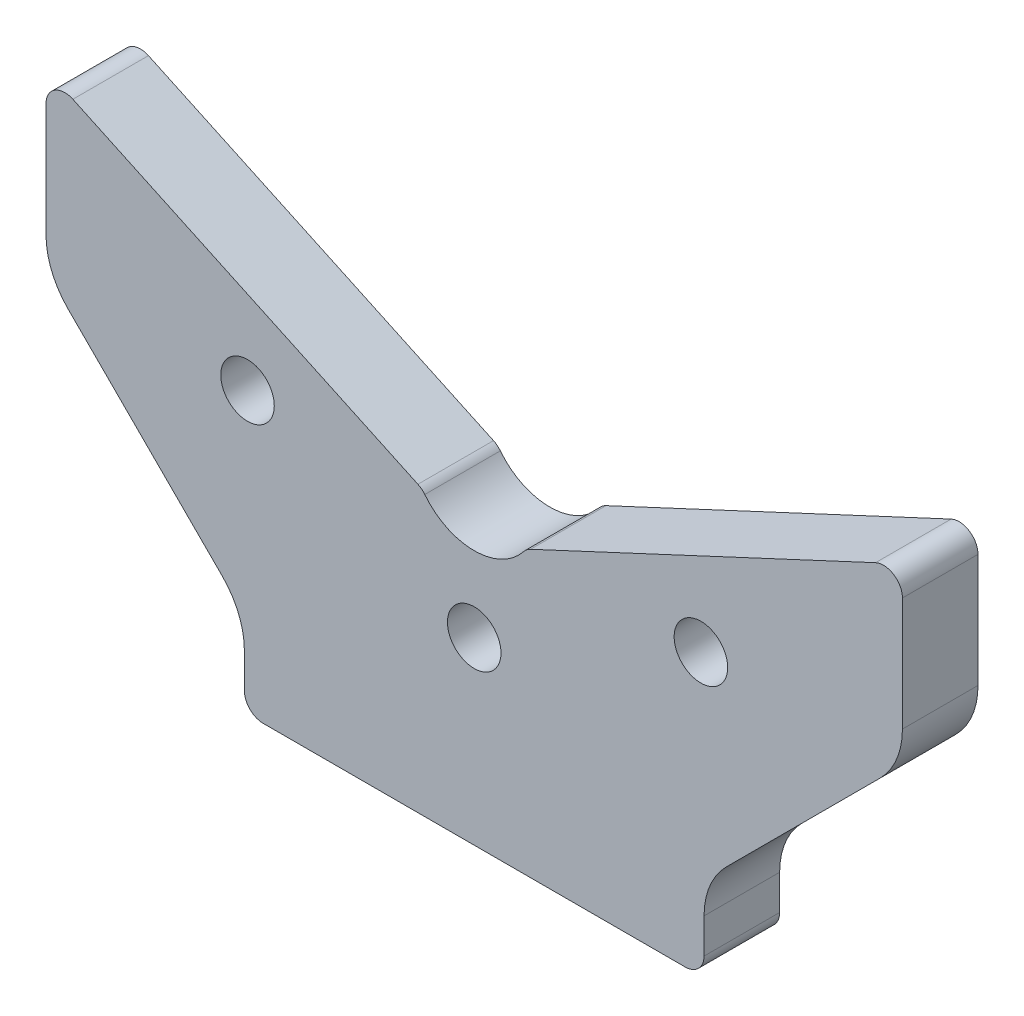
ISO-10303-21;
HEADER;
FILE_DESCRIPTION(('STEP AP214'),'2;1');
FILE_NAME('part.step','',(''),(''),'','','');
FILE_SCHEMA(('AUTOMOTIVE_DESIGN { 1 0 10303 214 1 1 1 1 }'));
ENDSEC;
DATA;
#1=APPLICATION_CONTEXT('core data for automotive mechanical design processes');
#2=APPLICATION_PROTOCOL_DEFINITION('international standard','automotive_design',2000,#1);
#3=PRODUCT_CONTEXT('',#1,'mechanical');
#4=PRODUCT('Part','Part','',(#3));
#5=PRODUCT_RELATED_PRODUCT_CATEGORY('part','',(#4));
#6=PRODUCT_DEFINITION_FORMATION('','',#4);
#7=PRODUCT_DEFINITION_CONTEXT('part definition',#1,'design');
#8=PRODUCT_DEFINITION('design','',#6,#7);
#9=PRODUCT_DEFINITION_SHAPE('','',#8);
#10=(LENGTH_UNIT() NAMED_UNIT(*) SI_UNIT(.MILLI.,.METRE.));
#11=(NAMED_UNIT(*) PLANE_ANGLE_UNIT() SI_UNIT($,.RADIAN.));
#12=(NAMED_UNIT(*) SI_UNIT($,.STERADIAN.) SOLID_ANGLE_UNIT());
#13=UNCERTAINTY_MEASURE_WITH_UNIT(LENGTH_MEASURE(1.E-05),#10,'distance_accuracy_value','');
#14=(GEOMETRIC_REPRESENTATION_CONTEXT(3) GLOBAL_UNCERTAINTY_ASSIGNED_CONTEXT((#13)) GLOBAL_UNIT_ASSIGNED_CONTEXT((#10,
#11,#12)) REPRESENTATION_CONTEXT('',''));
#15=CARTESIAN_POINT('',(0.,0.,0.));
#16=DIRECTION('',(0.,0.,1.));
#17=DIRECTION('',(1.,0.,0.));
#18=AXIS2_PLACEMENT_3D('',#15,#16,#17);
#19=CARTESIAN_POINT('',(0.,0.,12.));
#20=DIRECTION('',(0.,1.,0.));
#21=DIRECTION('',(-1.,0.,0.));
#22=AXIS2_PLACEMENT_3D('',#19,#20,#21);
#23=PLANE('',#22);
#24=DIRECTION('',(1.,0.,0.));
#25=VECTOR('',#24,1.);
#26=CARTESIAN_POINT('',(0.,0.,0.));
#27=LINE('',#26,#25);
#28=CARTESIAN_POINT('',(-33.5,0.,0.));
#29=VERTEX_POINT('',#28);
#30=CARTESIAN_POINT('',(33.5,0.,0.));
#31=VERTEX_POINT('',#30);
#32=EDGE_CURVE('E126',#29,#31,#27,.T.);
#33=ORIENTED_EDGE('',*,*,#32,.T.);
#34=DIRECTION('',(0.,0.,-1.));
#35=VECTOR('',#34,1.);
#36=CARTESIAN_POINT('',(33.5,0.,12.));
#37=LINE('',#36,#35);
#38=CARTESIAN_POINT('',(33.5,0.,12.));
#39=VERTEX_POINT('',#38);
#40=EDGE_CURVE('E11',#39,#31,#37,.T.);
#41=ORIENTED_EDGE('',*,*,#40,.F.);
#42=DIRECTION('',(1.,0.,0.));
#43=VECTOR('',#42,1.);
#44=CARTESIAN_POINT('',(0.,0.,12.));
#45=LINE('',#44,#43);
#46=CARTESIAN_POINT('',(-33.5,0.,12.));
#47=VERTEX_POINT('',#46);
#48=EDGE_CURVE('E132',#47,#39,#45,.T.);
#49=ORIENTED_EDGE('',*,*,#48,.F.);
#50=DIRECTION('',(0.,0.,-1.));
#51=VECTOR('',#50,1.);
#52=CARTESIAN_POINT('',(-33.5,0.,12.));
#53=LINE('',#52,#51);
#54=EDGE_CURVE('E202',#47,#29,#53,.T.);
#55=ORIENTED_EDGE('',*,*,#54,.T.);
#56=EDGE_LOOP('',(#33,#41,#49,#55));
#57=FACE_BOUND('',#56,.T.);
#58=ADVANCED_FACE('F38',(#57),#23,.F.);
#59=CARTESIAN_POINT('',(33.5,3.,12.));
#60=DIRECTION('',(0.,0.,-1.));
#61=DIRECTION('',(-1.,0.,0.));
#62=AXIS2_PLACEMENT_3D('',#59,#60,#61);
#63=CYLINDRICAL_SURFACE('',#62,3.);
#64=CARTESIAN_POINT('',(33.5,3.,0.));
#65=DIRECTION('',(0.,0.,1.));
#66=DIRECTION('',(1.,0.,0.));
#67=AXIS2_PLACEMENT_3D('',#64,#65,#66);
#68=CIRCLE('',#67,3.);
#69=CARTESIAN_POINT('',(36.5,3.,0.));
#70=VERTEX_POINT('',#69);
#71=EDGE_CURVE('E207',#31,#70,#68,.T.);
#72=ORIENTED_EDGE('',*,*,#71,.T.);
#73=DIRECTION('',(0.,0.,-1.));
#74=VECTOR('',#73,1.);
#75=CARTESIAN_POINT('',(36.5,3.,12.));
#76=LINE('',#75,#74);
#77=CARTESIAN_POINT('',(36.5,3.,12.));
#78=VERTEX_POINT('',#77);
#79=EDGE_CURVE('E46',#78,#70,#76,.T.);
#80=ORIENTED_EDGE('',*,*,#79,.F.);
#81=CARTESIAN_POINT('',(33.5,3.,12.));
#82=DIRECTION('',(0.,0.,1.));
#83=DIRECTION('',(1.,0.,0.));
#84=AXIS2_PLACEMENT_3D('',#81,#82,#83);
#85=CIRCLE('',#84,3.);
#86=EDGE_CURVE('E352',#39,#78,#85,.T.);
#87=ORIENTED_EDGE('',*,*,#86,.F.);
#88=ORIENTED_EDGE('',*,*,#40,.T.);
#89=EDGE_LOOP('',(#72,#80,#87,#88));
#90=FACE_BOUND('',#89,.T.);
#91=ADVANCED_FACE('F357',(#90),#63,.T.);
#92=CARTESIAN_POINT('',(36.5,3.,12.));
#93=DIRECTION('',(-1.,0.,0.));
#94=DIRECTION('',(0.,0.,1.));
#95=AXIS2_PLACEMENT_3D('',#92,#93,#94);
#96=PLANE('',#95);
#97=DIRECTION('',(0.,1.,0.));
#98=VECTOR('',#97,1.);
#99=CARTESIAN_POINT('',(36.5,3.,0.));
#100=LINE('',#99,#98);
#101=CARTESIAN_POINT('',(36.5,8.52943725152298,0.));
#102=VERTEX_POINT('',#101);
#103=EDGE_CURVE('E210',#70,#102,#100,.T.);
#104=ORIENTED_EDGE('',*,*,#103,.T.);
#105=DIRECTION('',(0.,0.,-1.));
#106=VECTOR('',#105,1.);
#107=CARTESIAN_POINT('',(36.5,8.52943725152298,12.));
#108=LINE('',#107,#106);
#109=CARTESIAN_POINT('',(36.5,8.52943725152298,12.));
#110=VERTEX_POINT('',#109);
#111=EDGE_CURVE('E287',#110,#102,#108,.T.);
#112=ORIENTED_EDGE('',*,*,#111,.F.);
#113=DIRECTION('',(0.,1.,0.));
#114=VECTOR('',#113,1.);
#115=CARTESIAN_POINT('',(36.5,3.,12.));
#116=LINE('',#115,#114);
#117=EDGE_CURVE('E296',#78,#110,#116,.T.);
#118=ORIENTED_EDGE('',*,*,#117,.F.);
#119=ORIENTED_EDGE('',*,*,#79,.T.);
#120=EDGE_LOOP('',(#104,#112,#118,#119));
#121=FACE_BOUND('',#120,.T.);
#122=ADVANCED_FACE('F294',(#121),#96,.F.);
#123=CARTESIAN_POINT('',(48.5,8.52943725152298,12.));
#124=DIRECTION('',(0.,0.,-1.));
#125=DIRECTION('',(-1.,0.,0.));
#126=AXIS2_PLACEMENT_3D('',#123,#124,#125);
#127=CYLINDRICAL_SURFACE('',#126,12.);
#128=CARTESIAN_POINT('',(48.5,8.52943725152298,0.));
#129=DIRECTION('',(0.,0.,-1.));
#130=DIRECTION('',(-1.,0.,0.));
#131=AXIS2_PLACEMENT_3D('',#128,#129,#130);
#132=CIRCLE('',#131,12.);
#133=CARTESIAN_POINT('',(40.0147186257614,17.0147186257616,0.));
#134=VERTEX_POINT('',#133);
#135=EDGE_CURVE('E212',#102,#134,#132,.T.);
#136=ORIENTED_EDGE('',*,*,#135,.T.);
#137=DIRECTION('',(0.,0.,-1.));
#138=VECTOR('',#137,1.);
#139=CARTESIAN_POINT('',(40.0147186257614,17.0147186257616,12.));
#140=LINE('',#139,#138);
#141=CARTESIAN_POINT('',(40.0147186257614,17.0147186257616,12.));
#142=VERTEX_POINT('',#141);
#143=EDGE_CURVE('E284',#142,#134,#140,.T.);
#144=ORIENTED_EDGE('',*,*,#143,.F.);
#145=CARTESIAN_POINT('',(48.5,8.52943725152298,12.));
#146=DIRECTION('',(0.,0.,-1.));
#147=DIRECTION('',(-1.,0.,0.));
#148=AXIS2_PLACEMENT_3D('',#145,#146,#147);
#149=CIRCLE('',#148,12.);
#150=EDGE_CURVE('E314',#110,#142,#149,.T.);
#151=ORIENTED_EDGE('',*,*,#150,.F.);
#152=ORIENTED_EDGE('',*,*,#111,.T.);
#153=EDGE_LOOP('',(#136,#144,#151,#152));
#154=FACE_BOUND('',#153,.T.);
#155=ADVANCED_FACE('F305',(#154),#127,.F.);
#156=CARTESIAN_POINT('',(40.0147186257614,17.0147186257616,12.));
#157=DIRECTION('',(-0.707106781186546,0.707106781186549,0.));
#158=DIRECTION('',(-0.707106781186549,-0.707106781186546,0.));
#159=AXIS2_PLACEMENT_3D('',#156,#157,#158);
#160=PLANE('',#159);
#161=DIRECTION('',(0.707106781186549,0.707106781186546,0.));
#162=VECTOR('',#161,1.);
#163=CARTESIAN_POINT('',(40.0147186257614,17.0147186257616,0.));
#164=LINE('',#163,#162);
#165=CARTESIAN_POINT('',(64.4852813742386,41.4852813742386,0.));
#166=VERTEX_POINT('',#165);
#167=EDGE_CURVE('E214',#134,#166,#164,.T.);
#168=ORIENTED_EDGE('',*,*,#167,.T.);
#169=DIRECTION('',(0.,0.,-1.));
#170=VECTOR('',#169,1.);
#171=CARTESIAN_POINT('',(64.4852813742386,41.4852813742386,12.));
#172=LINE('',#171,#170);
#173=CARTESIAN_POINT('',(64.4852813742386,41.4852813742386,12.));
#174=VERTEX_POINT('',#173);
#175=EDGE_CURVE('E281',#174,#166,#172,.T.);
#176=ORIENTED_EDGE('',*,*,#175,.F.);
#177=DIRECTION('',(0.707106781186549,0.707106781186546,0.));
#178=VECTOR('',#177,1.);
#179=CARTESIAN_POINT('',(40.0147186257614,17.0147186257616,12.));
#180=LINE('',#179,#178);
#181=EDGE_CURVE('E311',#142,#174,#180,.T.);
#182=ORIENTED_EDGE('',*,*,#181,.F.);
#183=ORIENTED_EDGE('',*,*,#143,.T.);
#184=EDGE_LOOP('',(#168,#176,#182,#183));
#185=FACE_BOUND('',#184,.T.);
#186=ADVANCED_FACE('F309',(#185),#160,.F.);
#187=CARTESIAN_POINT('',(56.,49.9705627484772,12.));
#188=DIRECTION('',(0.,0.,-1.));
#189=DIRECTION('',(-1.,0.,0.));
#190=AXIS2_PLACEMENT_3D('',#187,#188,#189);
#191=CYLINDRICAL_SURFACE('',#190,12.);
#192=CARTESIAN_POINT('',(56.,49.9705627484772,0.));
#193=DIRECTION('',(0.,0.,1.));
#194=DIRECTION('',(1.,0.,0.));
#195=AXIS2_PLACEMENT_3D('',#192,#193,#194);
#196=CIRCLE('',#195,12.);
#197=CARTESIAN_POINT('',(68.,49.9705627484772,0.));
#198=VERTEX_POINT('',#197);
#199=EDGE_CURVE('E216',#166,#198,#196,.T.);
#200=ORIENTED_EDGE('',*,*,#199,.T.);
#201=DIRECTION('',(0.,0.,-1.));
#202=VECTOR('',#201,1.);
#203=CARTESIAN_POINT('',(68.,49.9705627484772,12.));
#204=LINE('',#203,#202);
#205=CARTESIAN_POINT('',(68.,49.9705627484772,12.));
#206=VERTEX_POINT('',#205);
#207=EDGE_CURVE('E278',#206,#198,#204,.T.);
#208=ORIENTED_EDGE('',*,*,#207,.F.);
#209=CARTESIAN_POINT('',(56.,49.9705627484772,12.));
#210=DIRECTION('',(0.,0.,1.));
#211=DIRECTION('',(1.,0.,0.));
#212=AXIS2_PLACEMENT_3D('',#209,#210,#211);
#213=CIRCLE('',#212,12.);
#214=EDGE_CURVE('E313',#174,#206,#213,.T.);
#215=ORIENTED_EDGE('',*,*,#214,.F.);
#216=ORIENTED_EDGE('',*,*,#175,.T.);
#217=EDGE_LOOP('',(#200,#208,#215,#216));
#218=FACE_BOUND('',#217,.T.);
#219=ADVANCED_FACE('F369',(#218),#191,.T.);
#220=CARTESIAN_POINT('',(68.,49.9705627484772,12.));
#221=DIRECTION('',(-1.,0.,0.));
#222=DIRECTION('',(0.,0.,1.));
#223=AXIS2_PLACEMENT_3D('',#220,#221,#222);
#224=PLANE('',#223);
#225=DIRECTION('',(0.,1.,0.));
#226=VECTOR('',#225,1.);
#227=CARTESIAN_POINT('',(68.,49.9705627484772,0.));
#228=LINE('',#227,#226);
#229=CARTESIAN_POINT('',(68.,68.,0.));
#230=VERTEX_POINT('',#229);
#231=EDGE_CURVE('E218',#198,#230,#228,.T.);
#232=ORIENTED_EDGE('',*,*,#231,.T.);
#233=DIRECTION('',(0.,0.,-1.));
#234=VECTOR('',#233,1.);
#235=CARTESIAN_POINT('',(68.,68.,12.));
#236=LINE('',#235,#234);
#237=CARTESIAN_POINT('',(68.,68.,12.));
#238=VERTEX_POINT('',#237);
#239=EDGE_CURVE('E275',#238,#230,#236,.T.);
#240=ORIENTED_EDGE('',*,*,#239,.F.);
#241=DIRECTION('',(0.,1.,0.));
#242=VECTOR('',#241,1.);
#243=CARTESIAN_POINT('',(68.,49.9705627484772,12.));
#244=LINE('',#243,#242);
#245=EDGE_CURVE('E316',#206,#238,#244,.T.);
#246=ORIENTED_EDGE('',*,*,#245,.F.);
#247=ORIENTED_EDGE('',*,*,#207,.T.);
#248=EDGE_LOOP('',(#232,#240,#246,#247));
#249=FACE_BOUND('',#248,.T.);
#250=ADVANCED_FACE('F372',(#249),#224,.F.);
#251=CARTESIAN_POINT('',(65.,68.,12.));
#252=DIRECTION('',(0.,0.,-1.));
#253=DIRECTION('',(-1.,0.,0.));
#254=AXIS2_PLACEMENT_3D('',#251,#252,#253);
#255=CYLINDRICAL_SURFACE('',#254,3.);
#256=CARTESIAN_POINT('',(65.,68.,0.));
#257=DIRECTION('',(0.,0.,1.));
#258=DIRECTION('',(-1.,0.,0.));
#259=AXIS2_PLACEMENT_3D('',#256,#257,#258);
#260=CIRCLE('',#259,3.);
#261=CARTESIAN_POINT('',(63.7321452147779,70.7189233611099,0.));
#262=VERTEX_POINT('',#261);
#263=EDGE_CURVE('E220',#230,#262,#260,.T.);
#264=ORIENTED_EDGE('',*,*,#263,.T.);
#265=DIRECTION('',(0.,0.,-1.));
#266=VECTOR('',#265,1.);
#267=CARTESIAN_POINT('',(63.7321452147779,70.7189233611099,12.));
#268=LINE('',#267,#266);
#269=CARTESIAN_POINT('',(63.7321452147779,70.7189233611099,12.));
#270=VERTEX_POINT('',#269);
#271=EDGE_CURVE('E272',#270,#262,#268,.T.);
#272=ORIENTED_EDGE('',*,*,#271,.F.);
#273=CARTESIAN_POINT('',(65.,68.,12.));
#274=DIRECTION('',(0.,0.,1.));
#275=DIRECTION('',(-1.,0.,0.));
#276=AXIS2_PLACEMENT_3D('',#273,#274,#275);
#277=CIRCLE('',#276,3.);
#278=EDGE_CURVE('E322',#238,#270,#277,.T.);
#279=ORIENTED_EDGE('',*,*,#278,.F.);
#280=ORIENTED_EDGE('',*,*,#239,.T.);
#281=EDGE_LOOP('',(#264,#272,#279,#280));
#282=FACE_BOUND('',#281,.T.);
#283=ADVANCED_FACE('F376',(#282),#255,.T.);
#284=CARTESIAN_POINT('',(63.7321452147779,70.7189233611099,12.));
#285=DIRECTION('',(0.422618261740705,-0.906307787036647,0.));
#286=DIRECTION('',(0.906307787036647,0.422618261740706,0.));
#287=AXIS2_PLACEMENT_3D('',#284,#285,#286);
#288=PLANE('',#287);
#289=DIRECTION('',(-0.906307787036647,-0.422618261740706,0.));
#290=VECTOR('',#289,1.);
#291=CARTESIAN_POINT('',(63.7321452147779,70.7189233611099,0.));
#292=LINE('',#291,#290);
#293=CARTESIAN_POINT('',(8.93961735786246,45.1687480117587,0.));
#294=VERTEX_POINT('',#293);
#295=EDGE_CURVE('E222',#262,#294,#292,.T.);
#296=ORIENTED_EDGE('',*,*,#295,.T.);
#297=DIRECTION('',(0.,0.,-1.));
#298=VECTOR('',#297,1.);
#299=CARTESIAN_POINT('',(8.93961735786246,45.1687480117587,12.));
#300=LINE('',#299,#298);
#301=CARTESIAN_POINT('',(8.93961735786246,45.1687480117587,12.));
#302=VERTEX_POINT('',#301);
#303=EDGE_CURVE('E269',#302,#294,#300,.T.);
#304=ORIENTED_EDGE('',*,*,#303,.F.);
#305=DIRECTION('',(-0.906307787036647,-0.422618261740706,0.));
#306=VECTOR('',#305,1.);
#307=CARTESIAN_POINT('',(63.7321452147779,70.7189233611099,12.));
#308=LINE('',#307,#306);
#309=EDGE_CURVE('E324',#270,#302,#308,.T.);
#310=ORIENTED_EDGE('',*,*,#309,.F.);
#311=ORIENTED_EDGE('',*,*,#271,.T.);
#312=EDGE_LOOP('',(#296,#304,#310,#311));
#313=FACE_BOUND('',#312,.T.);
#314=ADVANCED_FACE('F380',(#313),#288,.F.);
#315=CARTESIAN_POINT('',(10.2074721430846,42.4498246506488,12.));
#316=DIRECTION('',(0.,0.,-1.));
#317=DIRECTION('',(-1.,0.,0.));
#318=AXIS2_PLACEMENT_3D('',#315,#316,#317);
#319=CYLINDRICAL_SURFACE('',#318,3.);
#320=CARTESIAN_POINT('',(10.2074721430846,42.4498246506488,0.));
#321=DIRECTION('',(0.,0.,1.));
#322=DIRECTION('',(-1.,0.,0.));
#323=AXIS2_PLACEMENT_3D('',#320,#321,#322);
#324=CIRCLE('',#323,3.);
#325=CARTESIAN_POINT('',(7.8519016485266,44.3075888028403,0.));
#326=VERTEX_POINT('',#325);
#327=EDGE_CURVE('E224',#294,#326,#324,.T.);
#328=ORIENTED_EDGE('',*,*,#327,.T.);
#329=DIRECTION('',(0.,0.,-1.));
#330=VECTOR('',#329,1.);
#331=CARTESIAN_POINT('',(7.8519016485266,44.3075888028403,12.));
#332=LINE('',#331,#330);
#333=CARTESIAN_POINT('',(7.8519016485266,44.3075888028403,12.));
#334=VERTEX_POINT('',#333);
#335=EDGE_CURVE('E266',#334,#326,#332,.T.);
#336=ORIENTED_EDGE('',*,*,#335,.F.);
#337=CARTESIAN_POINT('',(10.2074721430846,42.4498246506488,12.));
#338=DIRECTION('',(0.,0.,1.));
#339=DIRECTION('',(-1.,0.,0.));
#340=AXIS2_PLACEMENT_3D('',#337,#338,#339);
#341=CIRCLE('',#340,3.);
#342=EDGE_CURVE('E326',#302,#334,#341,.T.);
#343=ORIENTED_EDGE('',*,*,#342,.F.);
#344=ORIENTED_EDGE('',*,*,#303,.T.);
#345=EDGE_LOOP('',(#328,#336,#343,#344));
#346=FACE_BOUND('',#345,.T.);
#347=ADVANCED_FACE('F384',(#346),#319,.T.);
#348=CARTESIAN_POINT('',(0.,50.500135976812,12.));
#349=DIRECTION('',(0.,0.,-1.));
#350=DIRECTION('',(-1.,0.,0.));
#351=AXIS2_PLACEMENT_3D('',#348,#349,#350);
#352=CYLINDRICAL_SURFACE('',#351,10.);
#353=CARTESIAN_POINT('',(0.,50.500135976812,0.));
#354=DIRECTION('',(0.,0.,-1.));
#355=DIRECTION('',(1.,0.,0.));
#356=AXIS2_PLACEMENT_3D('',#353,#354,#355);
#357=CIRCLE('',#356,10.);
#358=CARTESIAN_POINT('',(-7.8519016485266,44.3075888028403,0.));
#359=VERTEX_POINT('',#358);
#360=EDGE_CURVE('E226',#326,#359,#357,.T.);
#361=ORIENTED_EDGE('',*,*,#360,.T.);
#362=DIRECTION('',(0.,0.,-1.));
#363=VECTOR('',#362,1.);
#364=CARTESIAN_POINT('',(-7.8519016485266,44.3075888028403,12.));
#365=LINE('',#364,#363);
#366=CARTESIAN_POINT('',(-7.8519016485266,44.3075888028403,12.));
#367=VERTEX_POINT('',#366);
#368=EDGE_CURVE('E263',#367,#359,#365,.T.);
#369=ORIENTED_EDGE('',*,*,#368,.F.);
#370=CARTESIAN_POINT('',(0.,50.500135976812,12.));
#371=DIRECTION('',(0.,0.,-1.));
#372=DIRECTION('',(1.,0.,0.));
#373=AXIS2_PLACEMENT_3D('',#370,#371,#372);
#374=CIRCLE('',#373,10.);
#375=EDGE_CURVE('E328',#334,#367,#374,.T.);
#376=ORIENTED_EDGE('',*,*,#375,.F.);
#377=ORIENTED_EDGE('',*,*,#335,.T.);
#378=EDGE_LOOP('',(#361,#369,#376,#377));
#379=FACE_BOUND('',#378,.T.);
#380=ADVANCED_FACE('F388',(#379),#352,.F.);
#381=CARTESIAN_POINT('',(-10.2074721430846,42.4498246506488,12.));
#382=DIRECTION('',(0.,0.,-1.));
#383=DIRECTION('',(-1.,0.,0.));
#384=AXIS2_PLACEMENT_3D('',#381,#382,#383);
#385=CYLINDRICAL_SURFACE('',#384,3.);
#386=CARTESIAN_POINT('',(-10.2074721430846,42.4498246506488,0.));
#387=DIRECTION('',(0.,0.,1.));
#388=DIRECTION('',(1.,0.,0.));
#389=AXIS2_PLACEMENT_3D('',#386,#387,#388);
#390=CIRCLE('',#389,3.);
#391=CARTESIAN_POINT('',(-8.93961735786246,45.1687480117587,0.));
#392=VERTEX_POINT('',#391);
#393=EDGE_CURVE('E228',#359,#392,#390,.T.);
#394=ORIENTED_EDGE('',*,*,#393,.T.);
#395=DIRECTION('',(0.,0.,-1.));
#396=VECTOR('',#395,1.);
#397=CARTESIAN_POINT('',(-8.93961735786246,45.1687480117587,12.));
#398=LINE('',#397,#396);
#399=CARTESIAN_POINT('',(-8.93961735786246,45.1687480117587,12.));
#400=VERTEX_POINT('',#399);
#401=EDGE_CURVE('E260',#400,#392,#398,.T.);
#402=ORIENTED_EDGE('',*,*,#401,.F.);
#403=CARTESIAN_POINT('',(-10.2074721430846,42.4498246506488,12.));
#404=DIRECTION('',(0.,0.,1.));
#405=DIRECTION('',(1.,0.,0.));
#406=AXIS2_PLACEMENT_3D('',#403,#404,#405);
#407=CIRCLE('',#406,3.);
#408=EDGE_CURVE('E330',#367,#400,#407,.T.);
#409=ORIENTED_EDGE('',*,*,#408,.F.);
#410=ORIENTED_EDGE('',*,*,#368,.T.);
#411=EDGE_LOOP('',(#394,#402,#409,#410));
#412=FACE_BOUND('',#411,.T.);
#413=ADVANCED_FACE('F392',(#412),#385,.T.);
#414=CARTESIAN_POINT('',(-63.7321452147779,70.7189233611099,12.));
#415=DIRECTION('',(-0.422618261740705,-0.906307787036647,0.));
#416=DIRECTION('',(0.906307787036647,-0.422618261740706,0.));
#417=AXIS2_PLACEMENT_3D('',#414,#415,#416);
#418=PLANE('',#417);
#419=DIRECTION('',(-0.906307787036647,0.422618261740706,0.));
#420=VECTOR('',#419,1.);
#421=CARTESIAN_POINT('',(-63.7321452147779,70.7189233611099,0.));
#422=LINE('',#421,#420);
#423=CARTESIAN_POINT('',(-63.7321452147779,70.7189233611099,0.));
#424=VERTEX_POINT('',#423);
#425=EDGE_CURVE('E230',#392,#424,#422,.T.);
#426=ORIENTED_EDGE('',*,*,#425,.T.);
#427=DIRECTION('',(0.,0.,-1.));
#428=VECTOR('',#427,1.);
#429=CARTESIAN_POINT('',(-63.7321452147779,70.7189233611099,12.));
#430=LINE('',#429,#428);
#431=CARTESIAN_POINT('',(-63.7321452147779,70.7189233611099,12.));
#432=VERTEX_POINT('',#431);
#433=EDGE_CURVE('E257',#432,#424,#430,.T.);
#434=ORIENTED_EDGE('',*,*,#433,.F.);
#435=DIRECTION('',(-0.906307787036647,0.422618261740706,0.));
#436=VECTOR('',#435,1.);
#437=CARTESIAN_POINT('',(-63.7321452147779,70.7189233611099,12.));
#438=LINE('',#437,#436);
#439=EDGE_CURVE('E332',#400,#432,#438,.T.);
#440=ORIENTED_EDGE('',*,*,#439,.F.);
#441=ORIENTED_EDGE('',*,*,#401,.T.);
#442=EDGE_LOOP('',(#426,#434,#440,#441));
#443=FACE_BOUND('',#442,.T.);
#444=ADVANCED_FACE('F396',(#443),#418,.F.);
#445=CARTESIAN_POINT('',(-65.,68.,12.));
#446=DIRECTION('',(0.,0.,-1.));
#447=DIRECTION('',(-1.,0.,0.));
#448=AXIS2_PLACEMENT_3D('',#445,#446,#447);
#449=CYLINDRICAL_SURFACE('',#448,3.);
#450=CARTESIAN_POINT('',(-65.,68.,0.));
#451=DIRECTION('',(0.,0.,1.));
#452=DIRECTION('',(-1.,0.,0.));
#453=AXIS2_PLACEMENT_3D('',#450,#451,#452);
#454=CIRCLE('',#453,3.);
#455=CARTESIAN_POINT('',(-68.,68.,0.));
#456=VERTEX_POINT('',#455);
#457=EDGE_CURVE('E232',#424,#456,#454,.T.);
#458=ORIENTED_EDGE('',*,*,#457,.T.);
#459=DIRECTION('',(0.,0.,-1.));
#460=VECTOR('',#459,1.);
#461=CARTESIAN_POINT('',(-68.,68.,12.));
#462=LINE('',#461,#460);
#463=CARTESIAN_POINT('',(-68.,68.,12.));
#464=VERTEX_POINT('',#463);
#465=EDGE_CURVE('E254',#464,#456,#462,.T.);
#466=ORIENTED_EDGE('',*,*,#465,.F.);
#467=CARTESIAN_POINT('',(-65.,68.,12.));
#468=DIRECTION('',(0.,0.,1.));
#469=DIRECTION('',(-1.,0.,0.));
#470=AXIS2_PLACEMENT_3D('',#467,#468,#469);
#471=CIRCLE('',#470,3.);
#472=EDGE_CURVE('E334',#432,#464,#471,.T.);
#473=ORIENTED_EDGE('',*,*,#472,.F.);
#474=ORIENTED_EDGE('',*,*,#433,.T.);
#475=EDGE_LOOP('',(#458,#466,#473,#474));
#476=FACE_BOUND('',#475,.T.);
#477=ADVANCED_FACE('F400',(#476),#449,.T.);
#478=CARTESIAN_POINT('',(-68.,49.9705627484772,12.));
#479=DIRECTION('',(1.,0.,0.));
#480=DIRECTION('',(0.,0.,-1.));
#481=AXIS2_PLACEMENT_3D('',#478,#479,#480);
#482=PLANE('',#481);
#483=DIRECTION('',(0.,-1.,0.));
#484=VECTOR('',#483,1.);
#485=CARTESIAN_POINT('',(-68.,49.9705627484772,0.));
#486=LINE('',#485,#484);
#487=CARTESIAN_POINT('',(-68.,49.9705627484772,0.));
#488=VERTEX_POINT('',#487);
#489=EDGE_CURVE('E234',#456,#488,#486,.T.);
#490=ORIENTED_EDGE('',*,*,#489,.T.);
#491=DIRECTION('',(0.,0.,-1.));
#492=VECTOR('',#491,1.);
#493=CARTESIAN_POINT('',(-68.,49.9705627484772,12.));
#494=LINE('',#493,#492);
#495=CARTESIAN_POINT('',(-68.,49.9705627484772,12.));
#496=VERTEX_POINT('',#495);
#497=EDGE_CURVE('E251',#496,#488,#494,.T.);
#498=ORIENTED_EDGE('',*,*,#497,.F.);
#499=DIRECTION('',(0.,-1.,0.));
#500=VECTOR('',#499,1.);
#501=CARTESIAN_POINT('',(-68.,49.9705627484772,12.));
#502=LINE('',#501,#500);
#503=EDGE_CURVE('E336',#464,#496,#502,.T.);
#504=ORIENTED_EDGE('',*,*,#503,.F.);
#505=ORIENTED_EDGE('',*,*,#465,.T.);
#506=EDGE_LOOP('',(#490,#498,#504,#505));
#507=FACE_BOUND('',#506,.T.);
#508=ADVANCED_FACE('F404',(#507),#482,.F.);
#509=CARTESIAN_POINT('',(-56.,49.9705627484772,12.));
#510=DIRECTION('',(0.,0.,-1.));
#511=DIRECTION('',(-1.,0.,0.));
#512=AXIS2_PLACEMENT_3D('',#509,#510,#511);
#513=CYLINDRICAL_SURFACE('',#512,12.);
#514=CARTESIAN_POINT('',(-56.,49.9705627484772,0.));
#515=DIRECTION('',(0.,0.,1.));
#516=DIRECTION('',(-1.,0.,0.));
#517=AXIS2_PLACEMENT_3D('',#514,#515,#516);
#518=CIRCLE('',#517,12.);
#519=CARTESIAN_POINT('',(-64.4852813742386,41.4852813742386,0.));
#520=VERTEX_POINT('',#519);
#521=EDGE_CURVE('E236',#488,#520,#518,.T.);
#522=ORIENTED_EDGE('',*,*,#521,.T.);
#523=DIRECTION('',(0.,0.,-1.));
#524=VECTOR('',#523,1.);
#525=CARTESIAN_POINT('',(-64.4852813742386,41.4852813742386,12.));
#526=LINE('',#525,#524);
#527=CARTESIAN_POINT('',(-64.4852813742386,41.4852813742386,12.));
#528=VERTEX_POINT('',#527);
#529=EDGE_CURVE('E248',#528,#520,#526,.T.);
#530=ORIENTED_EDGE('',*,*,#529,.F.);
#531=CARTESIAN_POINT('',(-56.,49.9705627484772,12.));
#532=DIRECTION('',(0.,0.,1.));
#533=DIRECTION('',(-1.,0.,0.));
#534=AXIS2_PLACEMENT_3D('',#531,#532,#533);
#535=CIRCLE('',#534,12.);
#536=EDGE_CURVE('E338',#496,#528,#535,.T.);
#537=ORIENTED_EDGE('',*,*,#536,.F.);
#538=ORIENTED_EDGE('',*,*,#497,.T.);
#539=EDGE_LOOP('',(#522,#530,#537,#538));
#540=FACE_BOUND('',#539,.T.);
#541=ADVANCED_FACE('F344',(#540),#513,.T.);
#542=CARTESIAN_POINT('',(-40.0147186257614,17.0147186257616,12.));
#543=DIRECTION('',(0.707106781186546,0.707106781186549,0.));
#544=DIRECTION('',(-0.707106781186549,0.707106781186546,0.));
#545=AXIS2_PLACEMENT_3D('',#542,#543,#544);
#546=PLANE('',#545);
#547=DIRECTION('',(0.707106781186549,-0.707106781186546,0.));
#548=VECTOR('',#547,1.);
#549=CARTESIAN_POINT('',(-40.0147186257614,17.0147186257616,0.));
#550=LINE('',#549,#548);
#551=CARTESIAN_POINT('',(-40.0147186257614,17.0147186257616,0.));
#552=VERTEX_POINT('',#551);
#553=EDGE_CURVE('E238',#520,#552,#550,.T.);
#554=ORIENTED_EDGE('',*,*,#553,.T.);
#555=DIRECTION('',(0.,0.,-1.));
#556=VECTOR('',#555,1.);
#557=CARTESIAN_POINT('',(-40.0147186257614,17.0147186257616,12.));
#558=LINE('',#557,#556);
#559=CARTESIAN_POINT('',(-40.0147186257614,17.0147186257616,12.));
#560=VERTEX_POINT('',#559);
#561=EDGE_CURVE('E197',#560,#552,#558,.T.);
#562=ORIENTED_EDGE('',*,*,#561,.F.);
#563=DIRECTION('',(0.707106781186549,-0.707106781186546,0.));
#564=VECTOR('',#563,1.);
#565=CARTESIAN_POINT('',(-40.0147186257614,17.0147186257616,12.));
#566=LINE('',#565,#564);
#567=EDGE_CURVE('E188',#528,#560,#566,.T.);
#568=ORIENTED_EDGE('',*,*,#567,.F.);
#569=ORIENTED_EDGE('',*,*,#529,.T.);
#570=EDGE_LOOP('',(#554,#562,#568,#569));
#571=FACE_BOUND('',#570,.T.);
#572=ADVANCED_FACE('F348',(#571),#546,.F.);
#573=CARTESIAN_POINT('',(-48.5,8.52943725152298,12.));
#574=DIRECTION('',(0.,0.,-1.));
#575=DIRECTION('',(-1.,0.,0.));
#576=AXIS2_PLACEMENT_3D('',#573,#574,#575);
#577=CYLINDRICAL_SURFACE('',#576,12.);
#578=CARTESIAN_POINT('',(-48.5,8.52943725152298,0.));
#579=DIRECTION('',(0.,0.,-1.));
#580=DIRECTION('',(1.,0.,0.));
#581=AXIS2_PLACEMENT_3D('',#578,#579,#580);
#582=CIRCLE('',#581,12.);
#583=CARTESIAN_POINT('',(-36.5,8.52943725152298,0.));
#584=VERTEX_POINT('',#583);
#585=EDGE_CURVE('E196',#552,#584,#582,.T.);
#586=ORIENTED_EDGE('',*,*,#585,.T.);
#587=DIRECTION('',(0.,0.,-1.));
#588=VECTOR('',#587,1.);
#589=CARTESIAN_POINT('',(-36.5,8.52943725152298,12.));
#590=LINE('',#589,#588);
#591=CARTESIAN_POINT('',(-36.5,8.52943725152298,12.));
#592=VERTEX_POINT('',#591);
#593=EDGE_CURVE('E193',#592,#584,#590,.T.);
#594=ORIENTED_EDGE('',*,*,#593,.F.);
#595=CARTESIAN_POINT('',(-48.5,8.52943725152298,12.));
#596=DIRECTION('',(0.,0.,-1.));
#597=DIRECTION('',(1.,0.,0.));
#598=AXIS2_PLACEMENT_3D('',#595,#596,#597);
#599=CIRCLE('',#598,12.);
#600=EDGE_CURVE('E182',#560,#592,#599,.T.);
#601=ORIENTED_EDGE('',*,*,#600,.F.);
#602=ORIENTED_EDGE('',*,*,#561,.T.);
#603=EDGE_LOOP('',(#586,#594,#601,#602));
#604=FACE_BOUND('',#603,.T.);
#605=ADVANCED_FACE('F194',(#604),#577,.F.);
#606=CARTESIAN_POINT('',(-36.5,3.,12.));
#607=DIRECTION('',(1.,0.,0.));
#608=DIRECTION('',(0.,0.,-1.));
#609=AXIS2_PLACEMENT_3D('',#606,#607,#608);
#610=PLANE('',#609);
#611=DIRECTION('',(0.,-1.,0.));
#612=VECTOR('',#611,1.);
#613=CARTESIAN_POINT('',(-36.5,3.,0.));
#614=LINE('',#613,#612);
#615=CARTESIAN_POINT('',(-36.5,3.,0.));
#616=VERTEX_POINT('',#615);
#617=EDGE_CURVE('E119',#584,#616,#614,.T.);
#618=ORIENTED_EDGE('',*,*,#617,.T.);
#619=DIRECTION('',(0.,0.,-1.));
#620=VECTOR('',#619,1.);
#621=CARTESIAN_POINT('',(-36.5,3.,12.));
#622=LINE('',#621,#620);
#623=CARTESIAN_POINT('',(-36.5,3.,12.));
#624=VERTEX_POINT('',#623);
#625=EDGE_CURVE('E198',#624,#616,#622,.T.);
#626=ORIENTED_EDGE('',*,*,#625,.F.);
#627=DIRECTION('',(0.,-1.,0.));
#628=VECTOR('',#627,1.);
#629=CARTESIAN_POINT('',(-36.5,3.,12.));
#630=LINE('',#629,#628);
#631=EDGE_CURVE('E186',#592,#624,#630,.T.);
#632=ORIENTED_EDGE('',*,*,#631,.F.);
#633=ORIENTED_EDGE('',*,*,#593,.T.);
#634=EDGE_LOOP('',(#618,#626,#632,#633));
#635=FACE_BOUND('',#634,.T.);
#636=ADVANCED_FACE('F200',(#635),#610,.F.);
#637=CARTESIAN_POINT('',(-33.5,3.,12.));
#638=DIRECTION('',(0.,0.,-1.));
#639=DIRECTION('',(-1.,0.,0.));
#640=AXIS2_PLACEMENT_3D('',#637,#638,#639);
#641=CYLINDRICAL_SURFACE('',#640,3.);
#642=CARTESIAN_POINT('',(-33.5,3.,0.));
#643=DIRECTION('',(0.,0.,1.));
#644=DIRECTION('',(1.,0.,0.));
#645=AXIS2_PLACEMENT_3D('',#642,#643,#644);
#646=CIRCLE('',#645,3.);
#647=EDGE_CURVE('E242',#616,#29,#646,.T.);
#648=ORIENTED_EDGE('',*,*,#647,.T.);
#649=ORIENTED_EDGE('',*,*,#54,.F.);
#650=CARTESIAN_POINT('',(-33.5,3.,12.));
#651=DIRECTION('',(0.,0.,1.));
#652=DIRECTION('',(1.,0.,0.));
#653=AXIS2_PLACEMENT_3D('',#650,#651,#652);
#654=CIRCLE('',#653,3.);
#655=EDGE_CURVE('E54',#624,#47,#654,.T.);
#656=ORIENTED_EDGE('',*,*,#655,.F.);
#657=ORIENTED_EDGE('',*,*,#625,.T.);
#658=EDGE_LOOP('',(#648,#649,#656,#657));
#659=FACE_BOUND('',#658,.T.);
#660=ADVANCED_FACE('F350',(#659),#641,.T.);
#661=CARTESIAN_POINT('',(-33.5,3.,12.));
#662=DIRECTION('',(0.,0.,1.));
#663=DIRECTION('',(1.,0.,0.));
#664=AXIS2_PLACEMENT_3D('',#661,#662,#663);
#665=PLANE('',#664);
#666=CARTESIAN_POINT('',(-36.,44.5466766428424,12.));
#667=DIRECTION('',(0.,0.,1.));
#668=DIRECTION('',(1.,0.,0.));
#669=AXIS2_PLACEMENT_3D('',#666,#667,#668);
#670=CIRCLE('',#669,4.25);
#671=CARTESIAN_POINT('',(-31.75,44.5466766428424,12.));
#672=VERTEX_POINT('',#671);
#673=EDGE_CURVE('E441',#672,#672,#670,.T.);
#674=ORIENTED_EDGE('',*,*,#673,.F.);
#675=EDGE_LOOP('',(#674));
#676=FACE_BOUND('',#675,.T.);
#677=CARTESIAN_POINT('',(0.,28.5466766428424,12.));
#678=DIRECTION('',(0.,0.,1.));
#679=DIRECTION('',(1.,0.,0.));
#680=AXIS2_PLACEMENT_3D('',#677,#678,#679);
#681=CIRCLE('',#680,4.25);
#682=CARTESIAN_POINT('',(4.25,28.5466766428424,12.));
#683=VERTEX_POINT('',#682);
#684=EDGE_CURVE('E445',#683,#683,#681,.T.);
#685=ORIENTED_EDGE('',*,*,#684,.F.);
#686=EDGE_LOOP('',(#685));
#687=FACE_BOUND('',#686,.T.);
#688=CARTESIAN_POINT('',(36.,44.5466766428424,12.));
#689=DIRECTION('',(0.,0.,1.));
#690=DIRECTION('',(1.,0.,0.));
#691=AXIS2_PLACEMENT_3D('',#688,#689,#690);
#692=CIRCLE('',#691,4.25);
#693=CARTESIAN_POINT('',(40.25,44.5466766428424,12.));
#694=VERTEX_POINT('',#693);
#695=EDGE_CURVE('E453',#694,#694,#692,.T.);
#696=ORIENTED_EDGE('',*,*,#695,.F.);
#697=EDGE_LOOP('',(#696));
#698=FACE_BOUND('',#697,.T.);
#699=ORIENTED_EDGE('',*,*,#48,.T.);
#700=ORIENTED_EDGE('',*,*,#86,.T.);
#701=ORIENTED_EDGE('',*,*,#117,.T.);
#702=ORIENTED_EDGE('',*,*,#150,.T.);
#703=ORIENTED_EDGE('',*,*,#181,.T.);
#704=ORIENTED_EDGE('',*,*,#214,.T.);
#705=ORIENTED_EDGE('',*,*,#245,.T.);
#706=ORIENTED_EDGE('',*,*,#278,.T.);
#707=ORIENTED_EDGE('',*,*,#309,.T.);
#708=ORIENTED_EDGE('',*,*,#342,.T.);
#709=ORIENTED_EDGE('',*,*,#375,.T.);
#710=ORIENTED_EDGE('',*,*,#408,.T.);
#711=ORIENTED_EDGE('',*,*,#439,.T.);
#712=ORIENTED_EDGE('',*,*,#472,.T.);
#713=ORIENTED_EDGE('',*,*,#503,.T.);
#714=ORIENTED_EDGE('',*,*,#536,.T.);
#715=ORIENTED_EDGE('',*,*,#567,.T.);
#716=ORIENTED_EDGE('',*,*,#600,.T.);
#717=ORIENTED_EDGE('',*,*,#631,.T.);
#718=ORIENTED_EDGE('',*,*,#655,.T.);
#719=EDGE_LOOP('',(#699,#700,#701,#702,#703,#704,#705,#706,#707,#708,#709,#710,#711,#712,#713,
#714,#715,#716,#717,#718));
#720=FACE_BOUND('',#719,.T.);
#721=ADVANCED_FACE('F184',(#676,#687,#698,#720),#665,.T.);
#722=CARTESIAN_POINT('',(-33.5,3.,0.));
#723=DIRECTION('',(0.,0.,1.));
#724=DIRECTION('',(1.,0.,0.));
#725=AXIS2_PLACEMENT_3D('',#722,#723,#724);
#726=PLANE('',#725);
#727=CARTESIAN_POINT('',(-36.,44.5466766428424,0.));
#728=DIRECTION('',(0.,0.,1.));
#729=DIRECTION('',(1.,0.,0.));
#730=AXIS2_PLACEMENT_3D('',#727,#728,#729);
#731=CIRCLE('',#730,4.25);
#732=CARTESIAN_POINT('',(-31.75,44.5466766428424,0.));
#733=VERTEX_POINT('',#732);
#734=EDGE_CURVE('E444',#733,#733,#731,.T.);
#735=ORIENTED_EDGE('',*,*,#734,.T.);
#736=EDGE_LOOP('',(#735));
#737=FACE_BOUND('',#736,.T.);
#738=CARTESIAN_POINT('',(0.,28.5466766428424,0.));
#739=DIRECTION('',(0.,0.,1.));
#740=DIRECTION('',(1.,0.,0.));
#741=AXIS2_PLACEMENT_3D('',#738,#739,#740);
#742=CIRCLE('',#741,4.25);
#743=CARTESIAN_POINT('',(4.25,28.5466766428424,0.));
#744=VERTEX_POINT('',#743);
#745=EDGE_CURVE('E448',#744,#744,#742,.T.);
#746=ORIENTED_EDGE('',*,*,#745,.T.);
#747=EDGE_LOOP('',(#746));
#748=FACE_BOUND('',#747,.T.);
#749=CARTESIAN_POINT('',(36.,44.5466766428424,0.));
#750=DIRECTION('',(0.,0.,1.));
#751=DIRECTION('',(1.,0.,0.));
#752=AXIS2_PLACEMENT_3D('',#749,#750,#751);
#753=CIRCLE('',#752,4.25);
#754=CARTESIAN_POINT('',(40.25,44.5466766428424,0.));
#755=VERTEX_POINT('',#754);
#756=EDGE_CURVE('E208',#755,#755,#753,.T.);
#757=ORIENTED_EDGE('',*,*,#756,.T.);
#758=EDGE_LOOP('',(#757));
#759=FACE_BOUND('',#758,.T.);
#760=ORIENTED_EDGE('',*,*,#32,.F.);
#761=ORIENTED_EDGE('',*,*,#647,.F.);
#762=ORIENTED_EDGE('',*,*,#617,.F.);
#763=ORIENTED_EDGE('',*,*,#585,.F.);
#764=ORIENTED_EDGE('',*,*,#553,.F.);
#765=ORIENTED_EDGE('',*,*,#521,.F.);
#766=ORIENTED_EDGE('',*,*,#489,.F.);
#767=ORIENTED_EDGE('',*,*,#457,.F.);
#768=ORIENTED_EDGE('',*,*,#425,.F.);
#769=ORIENTED_EDGE('',*,*,#393,.F.);
#770=ORIENTED_EDGE('',*,*,#360,.F.);
#771=ORIENTED_EDGE('',*,*,#327,.F.);
#772=ORIENTED_EDGE('',*,*,#295,.F.);
#773=ORIENTED_EDGE('',*,*,#263,.F.);
#774=ORIENTED_EDGE('',*,*,#231,.F.);
#775=ORIENTED_EDGE('',*,*,#199,.F.);
#776=ORIENTED_EDGE('',*,*,#167,.F.);
#777=ORIENTED_EDGE('',*,*,#135,.F.);
#778=ORIENTED_EDGE('',*,*,#103,.F.);
#779=ORIENTED_EDGE('',*,*,#71,.F.);
#780=EDGE_LOOP('',(#760,#761,#762,#763,#764,#765,#766,#767,#768,#769,#770,#771,#772,#773,#774,
#775,#776,#777,#778,#779));
#781=FACE_BOUND('',#780,.T.);
#782=ADVANCED_FACE('F300',(#737,#748,#759,#781),#726,.F.);
#783=CARTESIAN_POINT('',(36.,44.5466766428424,12.));
#784=DIRECTION('',(0.,0.,1.));
#785=DIRECTION('',(1.,0.,0.));
#786=AXIS2_PLACEMENT_3D('',#783,#784,#785);
#787=CYLINDRICAL_SURFACE('',#786,4.25);
#788=ORIENTED_EDGE('',*,*,#695,.T.);
#789=EDGE_LOOP('',(#788));
#790=FACE_BOUND('',#789,.T.);
#791=ORIENTED_EDGE('',*,*,#756,.F.);
#792=EDGE_LOOP('',(#791));
#793=FACE_BOUND('',#792,.T.);
#794=ADVANCED_FACE('F421',(#790,#793),#787,.F.);
#795=CARTESIAN_POINT('',(0.,28.5466766428424,12.));
#796=DIRECTION('',(0.,0.,1.));
#797=DIRECTION('',(1.,0.,0.));
#798=AXIS2_PLACEMENT_3D('',#795,#796,#797);
#799=CYLINDRICAL_SURFACE('',#798,4.25);
#800=ORIENTED_EDGE('',*,*,#684,.T.);
#801=EDGE_LOOP('',(#800));
#802=FACE_BOUND('',#801,.T.);
#803=ORIENTED_EDGE('',*,*,#745,.F.);
#804=EDGE_LOOP('',(#803));
#805=FACE_BOUND('',#804,.T.);
#806=ADVANCED_FACE('F428',(#802,#805),#799,.F.);
#807=CARTESIAN_POINT('',(-36.,44.5466766428424,12.));
#808=DIRECTION('',(0.,0.,1.));
#809=DIRECTION('',(1.,0.,0.));
#810=AXIS2_PLACEMENT_3D('',#807,#808,#809);
#811=CYLINDRICAL_SURFACE('',#810,4.25);
#812=ORIENTED_EDGE('',*,*,#673,.T.);
#813=EDGE_LOOP('',(#812));
#814=FACE_BOUND('',#813,.T.);
#815=ORIENTED_EDGE('',*,*,#734,.F.);
#816=EDGE_LOOP('',(#815));
#817=FACE_BOUND('',#816,.T.);
#818=ADVANCED_FACE('F432',(#814,#817),#811,.F.);
#819=CLOSED_SHELL('',(#58,#91,#122,#155,#186,#219,#250,#283,#314,#347,#380,#413,#444,#477,#508,
#541,#572,#605,#636,#660,#721,#782,#794,#806,#818));
#820=MANIFOLD_SOLID_BREP('B2',#819);
#821=ADVANCED_BREP_SHAPE_REPRESENTATION('',(#18,#820),#14);
#822=SHAPE_DEFINITION_REPRESENTATION(#9,#821);
ENDSEC;
END-ISO-10303-21;
